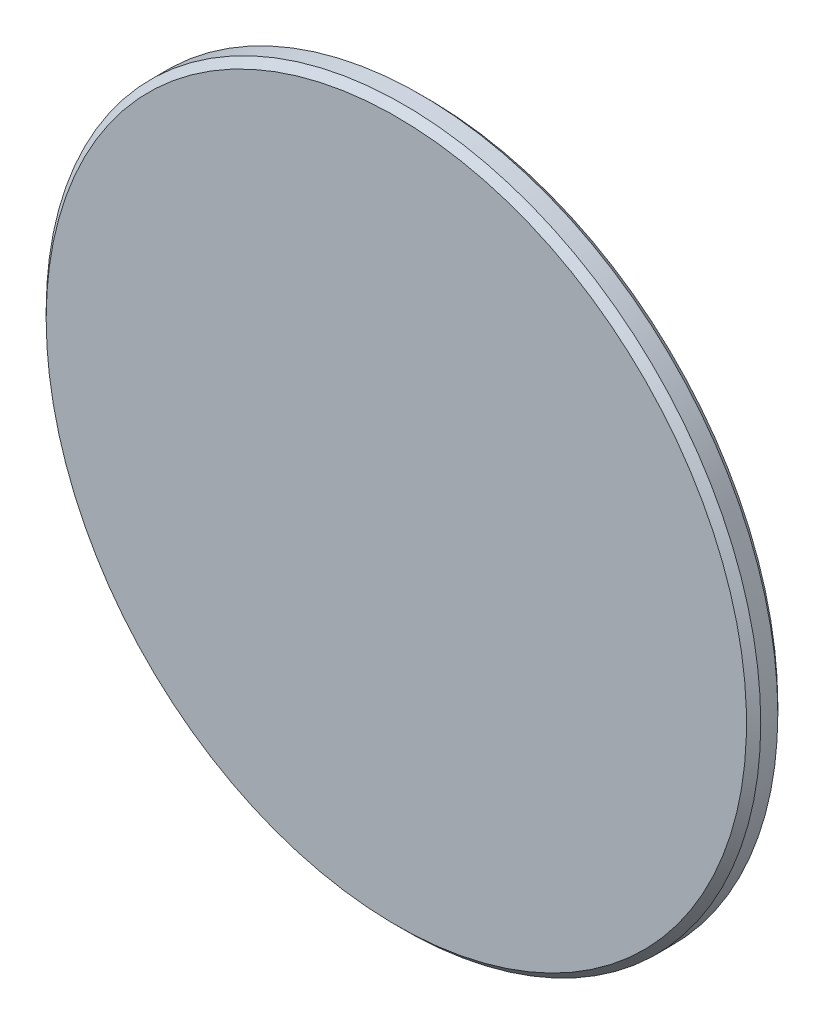
ISO-10303-21;
HEADER;
FILE_DESCRIPTION(('STEP AP214'),'2;1');
FILE_NAME('part.step','',(''),(''),'','','');
FILE_SCHEMA(('AUTOMOTIVE_DESIGN { 1 0 10303 214 1 1 1 1 }'));
ENDSEC;
DATA;
#1=APPLICATION_CONTEXT('core data for automotive mechanical design processes');
#2=APPLICATION_PROTOCOL_DEFINITION('international standard','automotive_design',2000,#1);
#3=PRODUCT_CONTEXT('',#1,'mechanical');
#4=PRODUCT('Part','Part','',(#3));
#5=PRODUCT_RELATED_PRODUCT_CATEGORY('part','',(#4));
#6=PRODUCT_DEFINITION_FORMATION('','',#4);
#7=PRODUCT_DEFINITION_CONTEXT('part definition',#1,'design');
#8=PRODUCT_DEFINITION('design','',#6,#7);
#9=PRODUCT_DEFINITION_SHAPE('','',#8);
#10=(LENGTH_UNIT() NAMED_UNIT(*) SI_UNIT(.MILLI.,.METRE.));
#11=(NAMED_UNIT(*) PLANE_ANGLE_UNIT() SI_UNIT($,.RADIAN.));
#12=(NAMED_UNIT(*) SI_UNIT($,.STERADIAN.) SOLID_ANGLE_UNIT());
#13=UNCERTAINTY_MEASURE_WITH_UNIT(LENGTH_MEASURE(1.E-05),#10,'distance_accuracy_value','');
#14=(GEOMETRIC_REPRESENTATION_CONTEXT(3) GLOBAL_UNCERTAINTY_ASSIGNED_CONTEXT((#13)) GLOBAL_UNIT_ASSIGNED_CONTEXT((#10,
#11,#12)) REPRESENTATION_CONTEXT('',''));
#15=CARTESIAN_POINT('',(0.,0.,0.));
#16=DIRECTION('',(0.,0.,1.));
#17=DIRECTION('',(1.,0.,0.));
#18=AXIS2_PLACEMENT_3D('',#15,#16,#17);
#19=CARTESIAN_POINT('',(0.,0.,-6.96999999999999));
#20=DIRECTION('',(0.,0.,-1.));
#21=DIRECTION('',(-1.,0.,0.));
#22=AXIS2_PLACEMENT_3D('',#19,#20,#21);
#23=PLANE('',#22);
#24=CARTESIAN_POINT('',(0.,0.,-6.96999999977563));
#25=DIRECTION('',(0.,0.,-1.));
#26=DIRECTION('',(-1.,0.,0.));
#27=AXIS2_PLACEMENT_3D('',#24,#25,#26);
#28=CIRCLE('',#27,12.3000000002244);
#29=CARTESIAN_POINT('',(-12.3000000002244,0.,-6.96999999977563));
#30=VERTEX_POINT('',#29);
#31=EDGE_CURVE('E18',#30,#30,#28,.T.);
#32=ORIENTED_EDGE('',*,*,#31,.F.);
#33=EDGE_LOOP('',(#32));
#34=FACE_BOUND('',#33,.T.);
#35=ADVANCED_FACE('F15',(#34),#23,.F.);
#36=CARTESIAN_POINT('',(0.,0.,-7.21999999999999));
#37=DIRECTION('',(0.,0.,-1.));
#38=DIRECTION('',(-1.,0.,0.));
#39=AXIS2_PLACEMENT_3D('',#36,#37,#38);
#40=CONICAL_SURFACE('',#39,12.55,0.785398162500001);
#41=CARTESIAN_POINT('',(0.,0.,-7.21999999999999));
#42=DIRECTION('',(0.,0.,-1.));
#43=DIRECTION('',(-1.,0.,0.));
#44=AXIS2_PLACEMENT_3D('',#41,#42,#43);
#45=CIRCLE('',#44,12.55);
#46=CARTESIAN_POINT('',(-12.55,0.,-7.21999999999999));
#47=VERTEX_POINT('',#46);
#48=EDGE_CURVE('E26',#47,#47,#45,.T.);
#49=ORIENTED_EDGE('',*,*,#48,.F.);
#50=EDGE_LOOP('',(#49));
#51=FACE_BOUND('',#50,.T.);
#52=ORIENTED_EDGE('',*,*,#31,.T.);
#53=EDGE_LOOP('',(#52));
#54=FACE_BOUND('',#53,.T.);
#55=ADVANCED_FACE('F35',(#51,#54),#40,.T.);
#56=CARTESIAN_POINT('',(0.,0.,-6.96999999999999));
#57=DIRECTION('',(0.,0.,-1.));
#58=DIRECTION('',(-1.,0.,0.));
#59=AXIS2_PLACEMENT_3D('',#56,#57,#58);
#60=CYLINDRICAL_SURFACE('',#59,12.55);
#61=CARTESIAN_POINT('',(0.,0.,-7.81999999977563));
#62=DIRECTION('',(0.,0.,1.));
#63=DIRECTION('',(1.,0.,0.));
#64=AXIS2_PLACEMENT_3D('',#61,#62,#63);
#65=CIRCLE('',#64,12.5499999997756);
#66=CARTESIAN_POINT('',(12.5499999997756,0.,-7.81999999977563));
#67=VERTEX_POINT('',#66);
#68=EDGE_CURVE('E22',#67,#67,#65,.F.);
#69=ORIENTED_EDGE('',*,*,#68,.F.);
#70=EDGE_LOOP('',(#69));
#71=FACE_BOUND('',#70,.T.);
#72=ORIENTED_EDGE('',*,*,#48,.T.);
#73=EDGE_LOOP('',(#72));
#74=FACE_BOUND('',#73,.T.);
#75=ADVANCED_FACE('F42',(#71,#74),#60,.T.);
#76=CARTESIAN_POINT('',(0.,0.,-7.81999999977563));
#77=DIRECTION('',(0.,0.,1.));
#78=DIRECTION('',(1.,0.,0.));
#79=AXIS2_PLACEMENT_3D('',#76,#77,#78);
#80=CONICAL_SURFACE('',#79,12.5499999997756,0.7853981625);
#81=ORIENTED_EDGE('',*,*,#68,.T.);
#82=EDGE_LOOP('',(#81));
#83=FACE_BOUND('',#82,.T.);
#84=CARTESIAN_POINT('',(0.,0.,-8.06999999999999));
#85=DIRECTION('',(0.,0.,1.));
#86=DIRECTION('',(1.,0.,0.));
#87=AXIS2_PLACEMENT_3D('',#84,#85,#86);
#88=CIRCLE('',#87,12.3);
#89=CARTESIAN_POINT('',(12.3,0.,-8.06999999999999));
#90=VERTEX_POINT('',#89);
#91=EDGE_CURVE('E10',#90,#90,#88,.F.);
#92=ORIENTED_EDGE('',*,*,#91,.F.);
#93=EDGE_LOOP('',(#92));
#94=FACE_BOUND('',#93,.T.);
#95=ADVANCED_FACE('F46',(#83,#94),#80,.T.);
#96=CARTESIAN_POINT('',(0.,0.,-8.06999999999999));
#97=DIRECTION('',(0.,0.,-1.));
#98=DIRECTION('',(-1.,0.,0.));
#99=AXIS2_PLACEMENT_3D('',#96,#97,#98);
#100=PLANE('',#99);
#101=ORIENTED_EDGE('',*,*,#91,.T.);
#102=EDGE_LOOP('',(#101));
#103=FACE_BOUND('',#102,.T.);
#104=ADVANCED_FACE('F44',(#103),#100,.T.);
#105=CLOSED_SHELL('',(#35,#55,#75,#95,#104));
#106=MANIFOLD_SOLID_BREP('B1',#105);
#107=ADVANCED_BREP_SHAPE_REPRESENTATION('',(#18,#106),#14);
#108=SHAPE_DEFINITION_REPRESENTATION(#9,#107);
ENDSEC;
END-ISO-10303-21;
